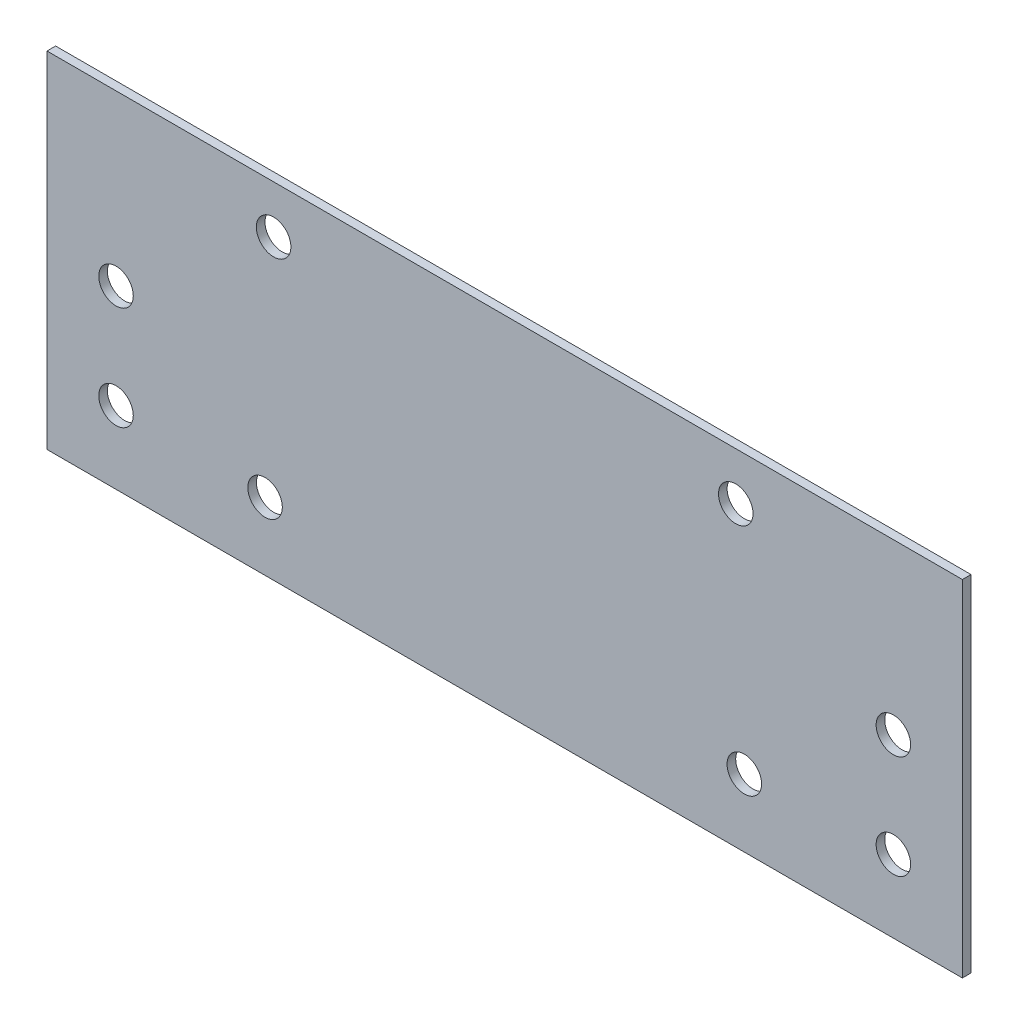
ISO-10303-21;
HEADER;
FILE_DESCRIPTION(('STEP AP214'),'2;1');
FILE_NAME('part.step','',(''),(''),'','','');
FILE_SCHEMA(('AUTOMOTIVE_DESIGN { 1 0 10303 214 1 1 1 1 }'));
ENDSEC;
DATA;
#1=APPLICATION_CONTEXT('core data for automotive mechanical design processes');
#2=APPLICATION_PROTOCOL_DEFINITION('international standard','automotive_design',2000,#1);
#3=PRODUCT_CONTEXT('',#1,'mechanical');
#4=PRODUCT('Part','Part','',(#3));
#5=PRODUCT_RELATED_PRODUCT_CATEGORY('part','',(#4));
#6=PRODUCT_DEFINITION_FORMATION('','',#4);
#7=PRODUCT_DEFINITION_CONTEXT('part definition',#1,'design');
#8=PRODUCT_DEFINITION('design','',#6,#7);
#9=PRODUCT_DEFINITION_SHAPE('','',#8);
#10=(LENGTH_UNIT() NAMED_UNIT(*) SI_UNIT(.MILLI.,.METRE.));
#11=(NAMED_UNIT(*) PLANE_ANGLE_UNIT() SI_UNIT($,.RADIAN.));
#12=(NAMED_UNIT(*) SI_UNIT($,.STERADIAN.) SOLID_ANGLE_UNIT());
#13=UNCERTAINTY_MEASURE_WITH_UNIT(LENGTH_MEASURE(1.E-05),#10,'distance_accuracy_value','');
#14=(GEOMETRIC_REPRESENTATION_CONTEXT(3) GLOBAL_UNCERTAINTY_ASSIGNED_CONTEXT((#13)) GLOBAL_UNIT_ASSIGNED_CONTEXT((#10,
#11,#12)) REPRESENTATION_CONTEXT('',''));
#15=CARTESIAN_POINT('',(0.,0.,0.));
#16=DIRECTION('',(0.,0.,1.));
#17=DIRECTION('',(1.,0.,0.));
#18=AXIS2_PLACEMENT_3D('',#15,#16,#17);
#19=CARTESIAN_POINT('',(-84.2125,-31.75,1.5875));
#20=DIRECTION('',(1.,0.,0.));
#21=DIRECTION('',(0.,0.,-1.));
#22=AXIS2_PLACEMENT_3D('',#19,#20,#21);
#23=PLANE('',#22);
#24=DIRECTION('',(0.,-1.,0.));
#25=VECTOR('',#24,1.);
#26=CARTESIAN_POINT('',(-84.2125,-31.75,0.));
#27=LINE('',#26,#25);
#28=CARTESIAN_POINT('',(-84.2125,31.75,0.));
#29=VERTEX_POINT('',#28);
#30=CARTESIAN_POINT('',(-84.2125,-31.75,0.));
#31=VERTEX_POINT('',#30);
#32=EDGE_CURVE('E96',#29,#31,#27,.T.);
#33=ORIENTED_EDGE('',*,*,#32,.T.);
#34=DIRECTION('',(0.,0.,-1.));
#35=VECTOR('',#34,1.);
#36=CARTESIAN_POINT('',(-84.2125,-31.75,1.5875));
#37=LINE('',#36,#35);
#38=CARTESIAN_POINT('',(-84.2125,-31.75,1.5875));
#39=VERTEX_POINT('',#38);
#40=EDGE_CURVE('E11',#39,#31,#37,.T.);
#41=ORIENTED_EDGE('',*,*,#40,.F.);
#42=DIRECTION('',(0.,-1.,0.));
#43=VECTOR('',#42,1.);
#44=CARTESIAN_POINT('',(-84.2125,-31.75,1.5875));
#45=LINE('',#44,#43);
#46=CARTESIAN_POINT('',(-84.2125,31.75,1.5875));
#47=VERTEX_POINT('',#46);
#48=EDGE_CURVE('E84',#47,#39,#45,.T.);
#49=ORIENTED_EDGE('',*,*,#48,.F.);
#50=DIRECTION('',(0.,0.,-1.));
#51=VECTOR('',#50,1.);
#52=CARTESIAN_POINT('',(-84.2125,31.75,1.5875));
#53=LINE('',#52,#51);
#54=EDGE_CURVE('E92',#47,#29,#53,.T.);
#55=ORIENTED_EDGE('',*,*,#54,.T.);
#56=EDGE_LOOP('',(#33,#41,#49,#55));
#57=FACE_BOUND('',#56,.T.);
#58=ADVANCED_FACE('F33',(#57),#23,.F.);
#59=CARTESIAN_POINT('',(84.2125,-31.75,1.5875));
#60=DIRECTION('',(0.,1.,0.));
#61=DIRECTION('',(-1.,0.,0.));
#62=AXIS2_PLACEMENT_3D('',#59,#60,#61);
#63=PLANE('',#62);
#64=DIRECTION('',(1.,0.,0.));
#65=VECTOR('',#64,1.);
#66=CARTESIAN_POINT('',(84.2125,-31.75,0.));
#67=LINE('',#66,#65);
#68=CARTESIAN_POINT('',(84.2125,-31.75,0.));
#69=VERTEX_POINT('',#68);
#70=EDGE_CURVE('E88',#31,#69,#67,.T.);
#71=ORIENTED_EDGE('',*,*,#70,.T.);
#72=DIRECTION('',(0.,0.,-1.));
#73=VECTOR('',#72,1.);
#74=CARTESIAN_POINT('',(84.2125,-31.75,1.5875));
#75=LINE('',#74,#73);
#76=CARTESIAN_POINT('',(84.2125,-31.75,1.5875));
#77=VERTEX_POINT('',#76);
#78=EDGE_CURVE('E41',#77,#69,#75,.T.);
#79=ORIENTED_EDGE('',*,*,#78,.F.);
#80=DIRECTION('',(1.,0.,0.));
#81=VECTOR('',#80,1.);
#82=CARTESIAN_POINT('',(84.2125,-31.75,1.5875));
#83=LINE('',#82,#81);
#84=EDGE_CURVE('E79',#39,#77,#83,.T.);
#85=ORIENTED_EDGE('',*,*,#84,.F.);
#86=ORIENTED_EDGE('',*,*,#40,.T.);
#87=EDGE_LOOP('',(#71,#79,#85,#86));
#88=FACE_BOUND('',#87,.T.);
#89=ADVANCED_FACE('F87',(#88),#63,.F.);
#90=CARTESIAN_POINT('',(84.2125,-31.75,1.5875));
#91=DIRECTION('',(-1.,0.,0.));
#92=DIRECTION('',(0.,-1.,0.));
#93=AXIS2_PLACEMENT_3D('',#90,#91,#92);
#94=PLANE('',#93);
#95=DIRECTION('',(0.,1.,0.));
#96=VECTOR('',#95,1.);
#97=CARTESIAN_POINT('',(84.2125,-31.75,0.));
#98=LINE('',#97,#96);
#99=CARTESIAN_POINT('',(84.2125,31.75,0.));
#100=VERTEX_POINT('',#99);
#101=EDGE_CURVE('E66',#69,#100,#98,.T.);
#102=ORIENTED_EDGE('',*,*,#101,.T.);
#103=DIRECTION('',(0.,0.,-1.));
#104=VECTOR('',#103,1.);
#105=CARTESIAN_POINT('',(84.2125,31.75,1.5875));
#106=LINE('',#105,#104);
#107=CARTESIAN_POINT('',(84.2125,31.75,1.5875));
#108=VERTEX_POINT('',#107);
#109=EDGE_CURVE('E89',#108,#100,#106,.T.);
#110=ORIENTED_EDGE('',*,*,#109,.F.);
#111=DIRECTION('',(0.,1.,0.));
#112=VECTOR('',#111,1.);
#113=CARTESIAN_POINT('',(84.2125,-31.75,1.5875));
#114=LINE('',#113,#112);
#115=EDGE_CURVE('E82',#77,#108,#114,.T.);
#116=ORIENTED_EDGE('',*,*,#115,.F.);
#117=ORIENTED_EDGE('',*,*,#78,.T.);
#118=EDGE_LOOP('',(#102,#110,#116,#117));
#119=FACE_BOUND('',#118,.T.);
#120=ADVANCED_FACE('F90',(#119),#94,.F.);
#121=CARTESIAN_POINT('',(84.2125,31.75,1.5875));
#122=DIRECTION('',(0.,-1.,0.));
#123=DIRECTION('',(1.,0.,0.));
#124=AXIS2_PLACEMENT_3D('',#121,#122,#123);
#125=PLANE('',#124);
#126=DIRECTION('',(-1.,0.,0.));
#127=VECTOR('',#126,1.);
#128=CARTESIAN_POINT('',(84.2125,31.75,0.));
#129=LINE('',#128,#127);
#130=EDGE_CURVE('E72',#100,#29,#129,.T.);
#131=ORIENTED_EDGE('',*,*,#130,.T.);
#132=ORIENTED_EDGE('',*,*,#54,.F.);
#133=DIRECTION('',(-1.,0.,0.));
#134=VECTOR('',#133,1.);
#135=CARTESIAN_POINT('',(84.2125,31.75,1.5875));
#136=LINE('',#135,#134);
#137=EDGE_CURVE('E49',#108,#47,#136,.T.);
#138=ORIENTED_EDGE('',*,*,#137,.F.);
#139=ORIENTED_EDGE('',*,*,#109,.T.);
#140=EDGE_LOOP('',(#131,#132,#138,#139));
#141=FACE_BOUND('',#140,.T.);
#142=ADVANCED_FACE('F104',(#141),#125,.F.);
#143=CARTESIAN_POINT('',(0.,0.,1.5875));
#144=DIRECTION('',(0.,0.,1.));
#145=DIRECTION('',(1.,0.,0.));
#146=AXIS2_PLACEMENT_3D('',#143,#144,#145);
#147=PLANE('',#146);
#148=CARTESIAN_POINT('',(71.5148999999999,0.65024000000001,1.5875));
#149=DIRECTION('',(0.,0.,1.));
#150=DIRECTION('',(1.,0.,0.));
#151=AXIS2_PLACEMENT_3D('',#148,#149,#150);
#152=CIRCLE('',#151,3.175);
#153=CARTESIAN_POINT('',(74.6898999999999,0.65024000000001,1.5875));
#154=VERTEX_POINT('',#153);
#155=EDGE_CURVE('E128',#154,#154,#152,.T.);
#156=ORIENTED_EDGE('',*,*,#155,.F.);
#157=EDGE_LOOP('',(#156));
#158=FACE_BOUND('',#157,.T.);
#159=CARTESIAN_POINT('',(-71.5125000000001,-18.39976,1.5875));
#160=DIRECTION('',(0.,0.,1.));
#161=DIRECTION('',(1.,0.,0.));
#162=AXIS2_PLACEMENT_3D('',#159,#160,#161);
#163=CIRCLE('',#162,3.175);
#164=CARTESIAN_POINT('',(-68.3375000000001,-18.39976,1.5875));
#165=VERTEX_POINT('',#164);
#166=EDGE_CURVE('E135',#165,#165,#163,.T.);
#167=ORIENTED_EDGE('',*,*,#166,.F.);
#168=EDGE_LOOP('',(#167));
#169=FACE_BOUND('',#168,.T.);
#170=CARTESIAN_POINT('',(-71.5125000000001,0.650240000000003,1.5875));
#171=DIRECTION('',(0.,0.,1.));
#172=DIRECTION('',(1.,0.,0.));
#173=AXIS2_PLACEMENT_3D('',#170,#171,#172);
#174=CIRCLE('',#173,3.175);
#175=CARTESIAN_POINT('',(-68.3375000000001,0.650240000000003,1.5875));
#176=VERTEX_POINT('',#175);
#177=EDGE_CURVE('E116',#176,#176,#174,.T.);
#178=ORIENTED_EDGE('',*,*,#177,.F.);
#179=EDGE_LOOP('',(#178));
#180=FACE_BOUND('',#179,.T.);
#181=CARTESIAN_POINT('',(-44.0907617277246,-19.3145871357376,1.5875));
#182=DIRECTION('',(0.,0.,1.));
#183=DIRECTION('',(1.,0.,0.));
#184=AXIS2_PLACEMENT_3D('',#181,#182,#183);
#185=CIRCLE('',#184,3.175);
#186=CARTESIAN_POINT('',(-40.9157617277247,-19.3145871357376,1.5875));
#187=VERTEX_POINT('',#186);
#188=EDGE_CURVE('E123',#187,#187,#185,.T.);
#189=ORIENTED_EDGE('',*,*,#188,.F.);
#190=EDGE_LOOP('',(#189));
#191=FACE_BOUND('',#190,.T.);
#192=CARTESIAN_POINT('',(71.5148999999999,-18.39976,1.5875));
#193=DIRECTION('',(0.,0.,1.));
#194=DIRECTION('',(1.,0.,0.));
#195=AXIS2_PLACEMENT_3D('',#192,#193,#194);
#196=CIRCLE('',#195,3.175);
#197=CARTESIAN_POINT('',(74.6898999999999,-18.39976,1.5875));
#198=VERTEX_POINT('',#197);
#199=EDGE_CURVE('E152',#198,#198,#196,.T.);
#200=ORIENTED_EDGE('',*,*,#199,.F.);
#201=EDGE_LOOP('',(#200));
#202=FACE_BOUND('',#201,.T.);
#203=CARTESIAN_POINT('',(44.0907617277246,-19.3145871357376,1.5875));
#204=DIRECTION('',(0.,0.,1.));
#205=DIRECTION('',(-1.,0.,0.));
#206=AXIS2_PLACEMENT_3D('',#203,#204,#205);
#207=CIRCLE('',#206,3.175);
#208=CARTESIAN_POINT('',(40.9157617277247,-19.3145871357376,1.5875));
#209=VERTEX_POINT('',#208);
#210=EDGE_CURVE('E146',#209,#209,#207,.T.);
#211=ORIENTED_EDGE('',*,*,#210,.F.);
#212=EDGE_LOOP('',(#211));
#213=FACE_BOUND('',#212,.T.);
#214=CARTESIAN_POINT('',(42.5159522762621,22.9603182491596,1.5875));
#215=DIRECTION('',(0.,0.,1.));
#216=DIRECTION('',(-1.,0.,0.));
#217=AXIS2_PLACEMENT_3D('',#214,#215,#216);
#218=CIRCLE('',#217,3.175);
#219=CARTESIAN_POINT('',(39.3409522762622,22.9603182491596,1.5875));
#220=VERTEX_POINT('',#219);
#221=EDGE_CURVE('E140',#220,#220,#218,.T.);
#222=ORIENTED_EDGE('',*,*,#221,.F.);
#223=EDGE_LOOP('',(#222));
#224=FACE_BOUND('',#223,.T.);
#225=CARTESIAN_POINT('',(-42.5159522762621,22.9603182491596,1.5875));
#226=DIRECTION('',(0.,0.,1.));
#227=DIRECTION('',(1.,0.,0.));
#228=AXIS2_PLACEMENT_3D('',#225,#226,#227);
#229=CIRCLE('',#228,3.175);
#230=CARTESIAN_POINT('',(-39.3409522762622,22.9603182491596,1.5875));
#231=VERTEX_POINT('',#230);
#232=EDGE_CURVE('E110',#231,#231,#229,.T.);
#233=ORIENTED_EDGE('',*,*,#232,.F.);
#234=EDGE_LOOP('',(#233));
#235=FACE_BOUND('',#234,.T.);
#236=ORIENTED_EDGE('',*,*,#48,.T.);
#237=ORIENTED_EDGE('',*,*,#84,.T.);
#238=ORIENTED_EDGE('',*,*,#115,.T.);
#239=ORIENTED_EDGE('',*,*,#137,.T.);
#240=EDGE_LOOP('',(#236,#237,#238,#239));
#241=FACE_BOUND('',#240,.T.);
#242=ADVANCED_FACE('F80',(#158,#169,#180,#191,#202,#213,#224,#235,#241),#147,.T.);
#243=CARTESIAN_POINT('',(0.,0.,0.));
#244=DIRECTION('',(0.,0.,1.));
#245=DIRECTION('',(1.,0.,0.));
#246=AXIS2_PLACEMENT_3D('',#243,#244,#245);
#247=PLANE('',#246);
#248=CARTESIAN_POINT('',(71.5148999999999,0.65024000000001,0.));
#249=DIRECTION('',(0.,0.,1.));
#250=DIRECTION('',(1.,0.,0.));
#251=AXIS2_PLACEMENT_3D('',#248,#249,#250);
#252=CIRCLE('',#251,3.175);
#253=CARTESIAN_POINT('',(74.6898999999999,0.65024000000001,0.));
#254=VERTEX_POINT('',#253);
#255=EDGE_CURVE('E131',#254,#254,#252,.T.);
#256=ORIENTED_EDGE('',*,*,#255,.T.);
#257=EDGE_LOOP('',(#256));
#258=FACE_BOUND('',#257,.T.);
#259=CARTESIAN_POINT('',(-71.5125000000001,-18.39976,0.));
#260=DIRECTION('',(0.,0.,1.));
#261=DIRECTION('',(1.,0.,0.));
#262=AXIS2_PLACEMENT_3D('',#259,#260,#261);
#263=CIRCLE('',#262,3.175);
#264=CARTESIAN_POINT('',(-68.3375000000001,-18.39976,0.));
#265=VERTEX_POINT('',#264);
#266=EDGE_CURVE('E120',#265,#265,#263,.T.);
#267=ORIENTED_EDGE('',*,*,#266,.T.);
#268=EDGE_LOOP('',(#267));
#269=FACE_BOUND('',#268,.T.);
#270=CARTESIAN_POINT('',(-71.5125000000001,0.650240000000003,0.));
#271=DIRECTION('',(0.,0.,1.));
#272=DIRECTION('',(1.,0.,0.));
#273=AXIS2_PLACEMENT_3D('',#270,#271,#272);
#274=CIRCLE('',#273,3.175);
#275=CARTESIAN_POINT('',(-68.3375000000001,0.650240000000003,0.));
#276=VERTEX_POINT('',#275);
#277=EDGE_CURVE('E119',#276,#276,#274,.T.);
#278=ORIENTED_EDGE('',*,*,#277,.T.);
#279=EDGE_LOOP('',(#278));
#280=FACE_BOUND('',#279,.T.);
#281=CARTESIAN_POINT('',(-44.0907617277246,-19.3145871357376,0.));
#282=DIRECTION('',(0.,0.,1.));
#283=DIRECTION('',(1.,0.,0.));
#284=AXIS2_PLACEMENT_3D('',#281,#282,#283);
#285=CIRCLE('',#284,3.175);
#286=CARTESIAN_POINT('',(-40.9157617277247,-19.3145871357376,0.));
#287=VERTEX_POINT('',#286);
#288=EDGE_CURVE('E113',#287,#287,#285,.T.);
#289=ORIENTED_EDGE('',*,*,#288,.T.);
#290=EDGE_LOOP('',(#289));
#291=FACE_BOUND('',#290,.T.);
#292=CARTESIAN_POINT('',(71.5148999999999,-18.39976,0.));
#293=DIRECTION('',(0.,0.,1.));
#294=DIRECTION('',(1.,0.,0.));
#295=AXIS2_PLACEMENT_3D('',#292,#293,#294);
#296=CIRCLE('',#295,3.175);
#297=CARTESIAN_POINT('',(74.6898999999999,-18.39976,0.));
#298=VERTEX_POINT('',#297);
#299=EDGE_CURVE('E132',#298,#298,#296,.T.);
#300=ORIENTED_EDGE('',*,*,#299,.T.);
#301=EDGE_LOOP('',(#300));
#302=FACE_BOUND('',#301,.T.);
#303=CARTESIAN_POINT('',(44.0907617277246,-19.3145871357376,0.));
#304=DIRECTION('',(0.,0.,1.));
#305=DIRECTION('',(-1.,0.,0.));
#306=AXIS2_PLACEMENT_3D('',#303,#304,#305);
#307=CIRCLE('',#306,3.175);
#308=CARTESIAN_POINT('',(40.9157617277247,-19.3145871357376,0.));
#309=VERTEX_POINT('',#308);
#310=EDGE_CURVE('E149',#309,#309,#307,.T.);
#311=ORIENTED_EDGE('',*,*,#310,.T.);
#312=EDGE_LOOP('',(#311));
#313=FACE_BOUND('',#312,.T.);
#314=CARTESIAN_POINT('',(42.5159522762621,22.9603182491596,0.));
#315=DIRECTION('',(0.,0.,1.));
#316=DIRECTION('',(-1.,0.,0.));
#317=AXIS2_PLACEMENT_3D('',#314,#315,#316);
#318=CIRCLE('',#317,3.175);
#319=CARTESIAN_POINT('',(39.3409522762622,22.9603182491596,0.));
#320=VERTEX_POINT('',#319);
#321=EDGE_CURVE('E143',#320,#320,#318,.T.);
#322=ORIENTED_EDGE('',*,*,#321,.T.);
#323=EDGE_LOOP('',(#322));
#324=FACE_BOUND('',#323,.T.);
#325=CARTESIAN_POINT('',(-42.5159522762621,22.9603182491596,0.));
#326=DIRECTION('',(0.,0.,1.));
#327=DIRECTION('',(1.,0.,0.));
#328=AXIS2_PLACEMENT_3D('',#325,#326,#327);
#329=CIRCLE('',#328,3.175);
#330=CARTESIAN_POINT('',(-39.3409522762622,22.9603182491596,0.));
#331=VERTEX_POINT('',#330);
#332=EDGE_CURVE('E99',#331,#331,#329,.T.);
#333=ORIENTED_EDGE('',*,*,#332,.T.);
#334=EDGE_LOOP('',(#333));
#335=FACE_BOUND('',#334,.T.);
#336=ORIENTED_EDGE('',*,*,#32,.F.);
#337=ORIENTED_EDGE('',*,*,#130,.F.);
#338=ORIENTED_EDGE('',*,*,#101,.F.);
#339=ORIENTED_EDGE('',*,*,#70,.F.);
#340=EDGE_LOOP('',(#336,#337,#338,#339));
#341=FACE_BOUND('',#340,.T.);
#342=ADVANCED_FACE('F107',(#258,#269,#280,#291,#302,#313,#324,#335,#341),#247,.F.);
#343=CARTESIAN_POINT('',(-42.5159522762621,22.9603182491596,0.));
#344=DIRECTION('',(0.,0.,1.));
#345=DIRECTION('',(1.,0.,0.));
#346=AXIS2_PLACEMENT_3D('',#343,#344,#345);
#347=CYLINDRICAL_SURFACE('',#346,3.175);
#348=ORIENTED_EDGE('',*,*,#332,.F.);
#349=EDGE_LOOP('',(#348));
#350=FACE_BOUND('',#349,.T.);
#351=ORIENTED_EDGE('',*,*,#232,.T.);
#352=EDGE_LOOP('',(#351));
#353=FACE_BOUND('',#352,.T.);
#354=ADVANCED_FACE('F178',(#350,#353),#347,.F.);
#355=CARTESIAN_POINT('',(42.5159522762621,22.9603182491596,0.));
#356=DIRECTION('',(0.,0.,1.));
#357=DIRECTION('',(1.,0.,0.));
#358=AXIS2_PLACEMENT_3D('',#355,#356,#357);
#359=CYLINDRICAL_SURFACE('',#358,3.175);
#360=ORIENTED_EDGE('',*,*,#321,.F.);
#361=EDGE_LOOP('',(#360));
#362=FACE_BOUND('',#361,.T.);
#363=ORIENTED_EDGE('',*,*,#221,.T.);
#364=EDGE_LOOP('',(#363));
#365=FACE_BOUND('',#364,.T.);
#366=ADVANCED_FACE('F180',(#362,#365),#359,.F.);
#367=CARTESIAN_POINT('',(44.0907617277246,-19.3145871357376,0.));
#368=DIRECTION('',(0.,0.,1.));
#369=DIRECTION('',(1.,0.,0.));
#370=AXIS2_PLACEMENT_3D('',#367,#368,#369);
#371=CYLINDRICAL_SURFACE('',#370,3.175);
#372=ORIENTED_EDGE('',*,*,#310,.F.);
#373=EDGE_LOOP('',(#372));
#374=FACE_BOUND('',#373,.T.);
#375=ORIENTED_EDGE('',*,*,#210,.T.);
#376=EDGE_LOOP('',(#375));
#377=FACE_BOUND('',#376,.T.);
#378=ADVANCED_FACE('F164',(#374,#377),#371,.F.);
#379=CARTESIAN_POINT('',(71.5148999999999,-18.39976,0.));
#380=DIRECTION('',(0.,0.,1.));
#381=DIRECTION('',(1.,0.,0.));
#382=AXIS2_PLACEMENT_3D('',#379,#380,#381);
#383=CYLINDRICAL_SURFACE('',#382,3.175);
#384=ORIENTED_EDGE('',*,*,#299,.F.);
#385=EDGE_LOOP('',(#384));
#386=FACE_BOUND('',#385,.T.);
#387=ORIENTED_EDGE('',*,*,#199,.T.);
#388=EDGE_LOOP('',(#387));
#389=FACE_BOUND('',#388,.T.);
#390=ADVANCED_FACE('F160',(#386,#389),#383,.F.);
#391=CARTESIAN_POINT('',(-44.0907617277246,-19.3145871357376,0.));
#392=DIRECTION('',(0.,0.,1.));
#393=DIRECTION('',(1.,0.,0.));
#394=AXIS2_PLACEMENT_3D('',#391,#392,#393);
#395=CYLINDRICAL_SURFACE('',#394,3.175);
#396=ORIENTED_EDGE('',*,*,#288,.F.);
#397=EDGE_LOOP('',(#396));
#398=FACE_BOUND('',#397,.T.);
#399=ORIENTED_EDGE('',*,*,#188,.T.);
#400=EDGE_LOOP('',(#399));
#401=FACE_BOUND('',#400,.T.);
#402=ADVANCED_FACE('F163',(#398,#401),#395,.F.);
#403=CARTESIAN_POINT('',(-71.5125000000001,0.650240000000003,0.));
#404=DIRECTION('',(0.,0.,1.));
#405=DIRECTION('',(1.,0.,0.));
#406=AXIS2_PLACEMENT_3D('',#403,#404,#405);
#407=CYLINDRICAL_SURFACE('',#406,3.175);
#408=ORIENTED_EDGE('',*,*,#277,.F.);
#409=EDGE_LOOP('',(#408));
#410=FACE_BOUND('',#409,.T.);
#411=ORIENTED_EDGE('',*,*,#177,.T.);
#412=EDGE_LOOP('',(#411));
#413=FACE_BOUND('',#412,.T.);
#414=ADVANCED_FACE('F249',(#410,#413),#407,.F.);
#415=CARTESIAN_POINT('',(-71.5125000000001,-18.39976,0.));
#416=DIRECTION('',(0.,0.,1.));
#417=DIRECTION('',(1.,0.,0.));
#418=AXIS2_PLACEMENT_3D('',#415,#416,#417);
#419=CYLINDRICAL_SURFACE('',#418,3.175);
#420=ORIENTED_EDGE('',*,*,#266,.F.);
#421=EDGE_LOOP('',(#420));
#422=FACE_BOUND('',#421,.T.);
#423=ORIENTED_EDGE('',*,*,#166,.T.);
#424=EDGE_LOOP('',(#423));
#425=FACE_BOUND('',#424,.T.);
#426=ADVANCED_FACE('F259',(#422,#425),#419,.F.);
#427=CARTESIAN_POINT('',(71.5148999999999,0.65024000000001,0.));
#428=DIRECTION('',(0.,0.,1.));
#429=DIRECTION('',(1.,0.,0.));
#430=AXIS2_PLACEMENT_3D('',#427,#428,#429);
#431=CYLINDRICAL_SURFACE('',#430,3.175);
#432=ORIENTED_EDGE('',*,*,#255,.F.);
#433=EDGE_LOOP('',(#432));
#434=FACE_BOUND('',#433,.T.);
#435=ORIENTED_EDGE('',*,*,#155,.T.);
#436=EDGE_LOOP('',(#435));
#437=FACE_BOUND('',#436,.T.);
#438=ADVANCED_FACE('F268',(#434,#437),#431,.F.);
#439=CLOSED_SHELL('',(#58,#89,#120,#142,#242,#342,#354,#366,#378,#390,#402,#414,#426,#438));
#440=MANIFOLD_SOLID_BREP('B2',#439);
#441=ADVANCED_BREP_SHAPE_REPRESENTATION('',(#18,#440),#14);
#442=SHAPE_DEFINITION_REPRESENTATION(#9,#441);
ENDSEC;
END-ISO-10303-21;
